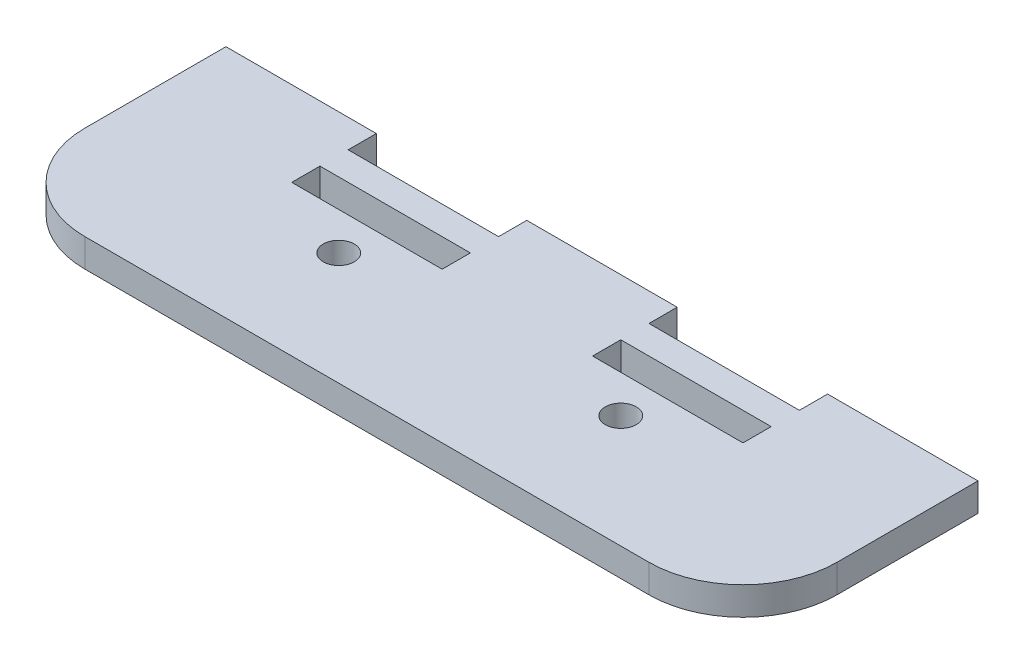
ISO-10303-21;
HEADER;
FILE_DESCRIPTION(('STEP AP214'),'2;1');
FILE_NAME('part.step','',(''),(''),'','','');
FILE_SCHEMA(('AUTOMOTIVE_DESIGN { 1 0 10303 214 1 1 1 1 }'));
ENDSEC;
DATA;
#1=APPLICATION_CONTEXT('core data for automotive mechanical design processes');
#2=APPLICATION_PROTOCOL_DEFINITION('international standard','automotive_design',2000,#1);
#3=PRODUCT_CONTEXT('',#1,'mechanical');
#4=PRODUCT('Part','Part','',(#3));
#5=PRODUCT_RELATED_PRODUCT_CATEGORY('part','',(#4));
#6=PRODUCT_DEFINITION_FORMATION('','',#4);
#7=PRODUCT_DEFINITION_CONTEXT('part definition',#1,'design');
#8=PRODUCT_DEFINITION('design','',#6,#7);
#9=PRODUCT_DEFINITION_SHAPE('','',#8);
#10=(LENGTH_UNIT() NAMED_UNIT(*) SI_UNIT(.MILLI.,.METRE.));
#11=(NAMED_UNIT(*) PLANE_ANGLE_UNIT() SI_UNIT($,.RADIAN.));
#12=(NAMED_UNIT(*) SI_UNIT($,.STERADIAN.) SOLID_ANGLE_UNIT());
#13=UNCERTAINTY_MEASURE_WITH_UNIT(LENGTH_MEASURE(1.E-05),#10,'distance_accuracy_value','');
#14=(GEOMETRIC_REPRESENTATION_CONTEXT(3) GLOBAL_UNCERTAINTY_ASSIGNED_CONTEXT((#13)) GLOBAL_UNIT_ASSIGNED_CONTEXT((#10,
#11,#12)) REPRESENTATION_CONTEXT('',''));
#15=CARTESIAN_POINT('',(0.,0.,0.));
#16=DIRECTION('',(0.,0.,1.));
#17=DIRECTION('',(1.,0.,0.));
#18=AXIS2_PLACEMENT_3D('',#15,#16,#17);
#19=CARTESIAN_POINT('',(-30.,3.,2.50000000000001));
#20=DIRECTION('',(0.,1.,0.));
#21=DIRECTION('',(0.,0.,1.));
#22=AXIS2_PLACEMENT_3D('',#19,#20,#21);
#23=PLANE('',#22);
#24=CARTESIAN_POINT('',(-15.,3.,0.500000000000002));
#25=DIRECTION('',(0.,1.,0.));
#26=DIRECTION('',(0.,0.,1.));
#27=AXIS2_PLACEMENT_3D('',#24,#25,#26);
#28=CIRCLE('',#27,1.65);
#29=CARTESIAN_POINT('',(-15.,3.,2.15));
#30=VERTEX_POINT('',#29);
#31=EDGE_CURVE('E257',#30,#30,#28,.T.);
#32=ORIENTED_EDGE('',*,*,#31,.F.);
#33=EDGE_LOOP('',(#32));
#34=FACE_BOUND('',#33,.T.);
#35=DIRECTION('',(-1.,0.,0.));
#36=VECTOR('',#35,1.);
#37=CARTESIAN_POINT('',(-24.,3.,-12.5));
#38=LINE('',#37,#36);
#39=CARTESIAN_POINT('',(-24.,3.,-12.5));
#40=VERTEX_POINT('',#39);
#41=CARTESIAN_POINT('',(-40.,3.,-12.5));
#42=VERTEX_POINT('',#41);
#43=EDGE_CURVE('E263',#40,#42,#38,.T.);
#44=ORIENTED_EDGE('',*,*,#43,.T.);
#45=DIRECTION('',(0.,0.,1.));
#46=VECTOR('',#45,1.);
#47=CARTESIAN_POINT('',(-40.,3.,2.49999999999994));
#48=LINE('',#47,#46);
#49=CARTESIAN_POINT('',(-40.,3.,2.49999999999994));
#50=VERTEX_POINT('',#49);
#51=EDGE_CURVE('E266',#42,#50,#48,.T.);
#52=ORIENTED_EDGE('',*,*,#51,.T.);
#53=CARTESIAN_POINT('',(-30.,3.,2.50000000000001));
#54=DIRECTION('',(0.,1.,0.));
#55=DIRECTION('',(0.,0.,1.));
#56=AXIS2_PLACEMENT_3D('',#53,#54,#55);
#57=CIRCLE('',#56,10.);
#58=CARTESIAN_POINT('',(-30.,3.,12.5));
#59=VERTEX_POINT('',#58);
#60=EDGE_CURVE('E269',#50,#59,#57,.T.);
#61=ORIENTED_EDGE('',*,*,#60,.T.);
#62=DIRECTION('',(1.,0.,0.));
#63=VECTOR('',#62,1.);
#64=CARTESIAN_POINT('',(29.9999999999999,3.,12.5));
#65=LINE('',#64,#63);
#66=CARTESIAN_POINT('',(29.9999999999999,3.,12.5));
#67=VERTEX_POINT('',#66);
#68=EDGE_CURVE('E271',#59,#67,#65,.T.);
#69=ORIENTED_EDGE('',*,*,#68,.T.);
#70=CARTESIAN_POINT('',(30.,3.,2.5));
#71=DIRECTION('',(0.,1.,0.));
#72=DIRECTION('',(0.,0.,-1.));
#73=AXIS2_PLACEMENT_3D('',#70,#71,#72);
#74=CIRCLE('',#73,10.);
#75=CARTESIAN_POINT('',(40.,3.,2.49999999999993));
#76=VERTEX_POINT('',#75);
#77=EDGE_CURVE('E273',#67,#76,#74,.T.);
#78=ORIENTED_EDGE('',*,*,#77,.T.);
#79=DIRECTION('',(0.,0.,-1.));
#80=VECTOR('',#79,1.);
#81=CARTESIAN_POINT('',(40.,3.,2.49999999999993));
#82=LINE('',#81,#80);
#83=CARTESIAN_POINT('',(40.,3.,-12.5));
#84=VERTEX_POINT('',#83);
#85=EDGE_CURVE('E275',#76,#84,#82,.T.);
#86=ORIENTED_EDGE('',*,*,#85,.T.);
#87=DIRECTION('',(-1.,0.,0.));
#88=VECTOR('',#87,1.);
#89=CARTESIAN_POINT('',(40.,3.,-12.5));
#90=LINE('',#89,#88);
#91=CARTESIAN_POINT('',(24.,3.,-12.5));
#92=VERTEX_POINT('',#91);
#93=EDGE_CURVE('E277',#84,#92,#90,.T.);
#94=ORIENTED_EDGE('',*,*,#93,.T.);
#95=DIRECTION('',(0.,0.,1.));
#96=VECTOR('',#95,1.);
#97=CARTESIAN_POINT('',(24.,3.,-9.5));
#98=LINE('',#97,#96);
#99=CARTESIAN_POINT('',(24.,3.,-9.5));
#100=VERTEX_POINT('',#99);
#101=EDGE_CURVE('E279',#92,#100,#98,.T.);
#102=ORIENTED_EDGE('',*,*,#101,.T.);
#103=DIRECTION('',(-1.,0.,0.));
#104=VECTOR('',#103,1.);
#105=CARTESIAN_POINT('',(24.,3.,-9.5));
#106=LINE('',#105,#104);
#107=CARTESIAN_POINT('',(8.,3.,-9.5));
#108=VERTEX_POINT('',#107);
#109=EDGE_CURVE('E281',#100,#108,#106,.T.);
#110=ORIENTED_EDGE('',*,*,#109,.T.);
#111=DIRECTION('',(0.,0.,-1.));
#112=VECTOR('',#111,1.);
#113=CARTESIAN_POINT('',(8.,3.,-9.5));
#114=LINE('',#113,#112);
#115=CARTESIAN_POINT('',(8.,3.,-12.5));
#116=VERTEX_POINT('',#115);
#117=EDGE_CURVE('E283',#108,#116,#114,.T.);
#118=ORIENTED_EDGE('',*,*,#117,.T.);
#119=DIRECTION('',(-1.,0.,0.));
#120=VECTOR('',#119,1.);
#121=CARTESIAN_POINT('',(8.,3.,-12.5));
#122=LINE('',#121,#120);
#123=CARTESIAN_POINT('',(-8.,3.,-12.5));
#124=VERTEX_POINT('',#123);
#125=EDGE_CURVE('E285',#116,#124,#122,.T.);
#126=ORIENTED_EDGE('',*,*,#125,.T.);
#127=DIRECTION('',(0.,0.,1.));
#128=VECTOR('',#127,1.);
#129=CARTESIAN_POINT('',(-8.,3.,-9.49999999999999));
#130=LINE('',#129,#128);
#131=CARTESIAN_POINT('',(-8.,3.,-9.49999999999999));
#132=VERTEX_POINT('',#131);
#133=EDGE_CURVE('E287',#124,#132,#130,.T.);
#134=ORIENTED_EDGE('',*,*,#133,.T.);
#135=DIRECTION('',(-1.,0.,0.));
#136=VECTOR('',#135,1.);
#137=CARTESIAN_POINT('',(-24.,3.,-9.49999999999999));
#138=LINE('',#137,#136);
#139=CARTESIAN_POINT('',(-24.,3.,-9.49999999999999));
#140=VERTEX_POINT('',#139);
#141=EDGE_CURVE('E289',#132,#140,#138,.T.);
#142=ORIENTED_EDGE('',*,*,#141,.T.);
#143=DIRECTION('',(0.,0.,-1.));
#144=VECTOR('',#143,1.);
#145=CARTESIAN_POINT('',(-24.,3.,-9.49999999999999));
#146=LINE('',#145,#144);
#147=EDGE_CURVE('E291',#140,#40,#146,.T.);
#148=ORIENTED_EDGE('',*,*,#147,.T.);
#149=EDGE_LOOP('',(#44,#52,#61,#69,#78,#86,#94,#102,#110,#118,#126,#134,#142,#148));
#150=FACE_BOUND('',#149,.T.);
#151=CARTESIAN_POINT('',(15.,3.,0.5));
#152=DIRECTION('',(0.,1.,0.));
#153=DIRECTION('',(0.,0.,1.));
#154=AXIS2_PLACEMENT_3D('',#151,#152,#153);
#155=CIRCLE('',#154,1.65);
#156=CARTESIAN_POINT('',(15.,3.,2.15));
#157=VERTEX_POINT('',#156);
#158=EDGE_CURVE('E251',#157,#157,#155,.T.);
#159=ORIENTED_EDGE('',*,*,#158,.F.);
#160=EDGE_LOOP('',(#159));
#161=FACE_BOUND('',#160,.T.);
#162=DIRECTION('',(-1.,0.,0.));
#163=VECTOR('',#162,1.);
#164=CARTESIAN_POINT('',(-24.,3.,-6.49999999999999));
#165=LINE('',#164,#163);
#166=CARTESIAN_POINT('',(-8.,3.,-6.49999999999999));
#167=VERTEX_POINT('',#166);
#168=CARTESIAN_POINT('',(-24.,3.,-6.49999999999999));
#169=VERTEX_POINT('',#168);
#170=EDGE_CURVE('E222',#167,#169,#165,.T.);
#171=ORIENTED_EDGE('',*,*,#170,.F.);
#172=DIRECTION('',(0.,0.,-1.));
#173=VECTOR('',#172,1.);
#174=CARTESIAN_POINT('',(-8.,3.,-3.49999999999999));
#175=LINE('',#174,#173);
#176=CARTESIAN_POINT('',(-8.,3.,-3.49999999999999));
#177=VERTEX_POINT('',#176);
#178=EDGE_CURVE('E220',#177,#167,#175,.T.);
#179=ORIENTED_EDGE('',*,*,#178,.F.);
#180=DIRECTION('',(1.,0.,0.));
#181=VECTOR('',#180,1.);
#182=CARTESIAN_POINT('',(-24.,3.,-3.49999999999999));
#183=LINE('',#182,#181);
#184=CARTESIAN_POINT('',(-24.,3.,-3.49999999999999));
#185=VERTEX_POINT('',#184);
#186=EDGE_CURVE('E228',#185,#177,#183,.T.);
#187=ORIENTED_EDGE('',*,*,#186,.F.);
#188=DIRECTION('',(0.,0.,1.));
#189=VECTOR('',#188,1.);
#190=CARTESIAN_POINT('',(-24.,3.,-6.49999999999999));
#191=LINE('',#190,#189);
#192=EDGE_CURVE('E225',#169,#185,#191,.T.);
#193=ORIENTED_EDGE('',*,*,#192,.F.);
#194=EDGE_LOOP('',(#171,#179,#187,#193));
#195=FACE_BOUND('',#194,.T.);
#196=DIRECTION('',(0.,0.,-1.));
#197=VECTOR('',#196,1.);
#198=CARTESIAN_POINT('',(24.,3.,-3.49999999999999));
#199=LINE('',#198,#197);
#200=CARTESIAN_POINT('',(24.,3.,-3.49999999999999));
#201=VERTEX_POINT('',#200);
#202=CARTESIAN_POINT('',(24.,3.,-6.49999999999999));
#203=VERTEX_POINT('',#202);
#204=EDGE_CURVE('E192',#201,#203,#199,.T.);
#205=ORIENTED_EDGE('',*,*,#204,.F.);
#206=DIRECTION('',(1.,0.,0.));
#207=VECTOR('',#206,1.);
#208=CARTESIAN_POINT('',(8.,3.,-3.49999999999999));
#209=LINE('',#208,#207);
#210=CARTESIAN_POINT('',(8.,3.,-3.49999999999999));
#211=VERTEX_POINT('',#210);
#212=EDGE_CURVE('E184',#211,#201,#209,.T.);
#213=ORIENTED_EDGE('',*,*,#212,.F.);
#214=DIRECTION('',(0.,0.,1.));
#215=VECTOR('',#214,1.);
#216=CARTESIAN_POINT('',(8.,3.,-6.49999999999999));
#217=LINE('',#216,#215);
#218=CARTESIAN_POINT('',(8.,3.,-6.49999999999999));
#219=VERTEX_POINT('',#218);
#220=EDGE_CURVE('E206',#219,#211,#217,.T.);
#221=ORIENTED_EDGE('',*,*,#220,.F.);
#222=DIRECTION('',(-1.,0.,0.));
#223=VECTOR('',#222,1.);
#224=CARTESIAN_POINT('',(8.,3.,-6.49999999999999));
#225=LINE('',#224,#223);
#226=EDGE_CURVE('E204',#203,#219,#225,.T.);
#227=ORIENTED_EDGE('',*,*,#226,.F.);
#228=EDGE_LOOP('',(#205,#213,#221,#227));
#229=FACE_BOUND('',#228,.T.);
#230=ADVANCED_FACE('F35',(#34,#150,#161,#195,#229),#23,.T.);
#231=CARTESIAN_POINT('',(-30.,0.,2.50000000000001));
#232=DIRECTION('',(0.,1.,0.));
#233=DIRECTION('',(0.,0.,1.));
#234=AXIS2_PLACEMENT_3D('',#231,#232,#233);
#235=PLANE('',#234);
#236=DIRECTION('',(0.,0.,-1.));
#237=VECTOR('',#236,1.);
#238=CARTESIAN_POINT('',(-8.,0.,-3.49999999999999));
#239=LINE('',#238,#237);
#240=CARTESIAN_POINT('',(-8.,0.,-3.49999999999999));
#241=VERTEX_POINT('',#240);
#242=CARTESIAN_POINT('',(-8.,0.,-6.49999999999999));
#243=VERTEX_POINT('',#242);
#244=EDGE_CURVE('E200',#241,#243,#239,.T.);
#245=ORIENTED_EDGE('',*,*,#244,.T.);
#246=DIRECTION('',(-1.,0.,0.));
#247=VECTOR('',#246,1.);
#248=CARTESIAN_POINT('',(-24.,0.,-6.49999999999999));
#249=LINE('',#248,#247);
#250=CARTESIAN_POINT('',(-24.,0.,-6.49999999999999));
#251=VERTEX_POINT('',#250);
#252=EDGE_CURVE('E233',#243,#251,#249,.T.);
#253=ORIENTED_EDGE('',*,*,#252,.T.);
#254=DIRECTION('',(0.,0.,1.));
#255=VECTOR('',#254,1.);
#256=CARTESIAN_POINT('',(-24.,0.,-6.49999999999999));
#257=LINE('',#256,#255);
#258=CARTESIAN_POINT('',(-24.,0.,-3.49999999999999));
#259=VERTEX_POINT('',#258);
#260=EDGE_CURVE('E236',#251,#259,#257,.T.);
#261=ORIENTED_EDGE('',*,*,#260,.T.);
#262=DIRECTION('',(1.,0.,0.));
#263=VECTOR('',#262,1.);
#264=CARTESIAN_POINT('',(-24.,0.,-3.49999999999999));
#265=LINE('',#264,#263);
#266=EDGE_CURVE('E223',#259,#241,#265,.T.);
#267=ORIENTED_EDGE('',*,*,#266,.T.);
#268=EDGE_LOOP('',(#245,#253,#261,#267));
#269=FACE_BOUND('',#268,.T.);
#270=DIRECTION('',(-1.,0.,0.));
#271=VECTOR('',#270,1.);
#272=CARTESIAN_POINT('',(-24.,0.,-12.5));
#273=LINE('',#272,#271);
#274=CARTESIAN_POINT('',(-24.,0.,-12.5));
#275=VERTEX_POINT('',#274);
#276=CARTESIAN_POINT('',(-40.,0.,-12.5));
#277=VERTEX_POINT('',#276);
#278=EDGE_CURVE('E260',#275,#277,#273,.T.);
#279=ORIENTED_EDGE('',*,*,#278,.F.);
#280=DIRECTION('',(0.,0.,-1.));
#281=VECTOR('',#280,1.);
#282=CARTESIAN_POINT('',(-24.,0.,-9.49999999999999));
#283=LINE('',#282,#281);
#284=CARTESIAN_POINT('',(-24.,0.,-9.49999999999999));
#285=VERTEX_POINT('',#284);
#286=EDGE_CURVE('E267',#285,#275,#283,.T.);
#287=ORIENTED_EDGE('',*,*,#286,.F.);
#288=DIRECTION('',(-1.,0.,0.));
#289=VECTOR('',#288,1.);
#290=CARTESIAN_POINT('',(-24.,0.,-9.49999999999999));
#291=LINE('',#290,#289);
#292=CARTESIAN_POINT('',(-8.,0.,-9.49999999999999));
#293=VERTEX_POINT('',#292);
#294=EDGE_CURVE('E318',#293,#285,#291,.T.);
#295=ORIENTED_EDGE('',*,*,#294,.F.);
#296=DIRECTION('',(0.,0.,1.));
#297=VECTOR('',#296,1.);
#298=CARTESIAN_POINT('',(-8.,0.,-9.49999999999999));
#299=LINE('',#298,#297);
#300=CARTESIAN_POINT('',(-8.,0.,-12.5));
#301=VERTEX_POINT('',#300);
#302=EDGE_CURVE('E316',#301,#293,#299,.T.);
#303=ORIENTED_EDGE('',*,*,#302,.F.);
#304=DIRECTION('',(-1.,0.,0.));
#305=VECTOR('',#304,1.);
#306=CARTESIAN_POINT('',(8.,0.,-12.5));
#307=LINE('',#306,#305);
#308=CARTESIAN_POINT('',(8.,0.,-12.5));
#309=VERTEX_POINT('',#308);
#310=EDGE_CURVE('E314',#309,#301,#307,.T.);
#311=ORIENTED_EDGE('',*,*,#310,.F.);
#312=DIRECTION('',(0.,0.,-1.));
#313=VECTOR('',#312,1.);
#314=CARTESIAN_POINT('',(8.,0.,-9.5));
#315=LINE('',#314,#313);
#316=CARTESIAN_POINT('',(8.,0.,-9.5));
#317=VERTEX_POINT('',#316);
#318=EDGE_CURVE('E312',#317,#309,#315,.T.);
#319=ORIENTED_EDGE('',*,*,#318,.F.);
#320=DIRECTION('',(-1.,0.,0.));
#321=VECTOR('',#320,1.);
#322=CARTESIAN_POINT('',(24.,0.,-9.5));
#323=LINE('',#322,#321);
#324=CARTESIAN_POINT('',(24.,0.,-9.5));
#325=VERTEX_POINT('',#324);
#326=EDGE_CURVE('E310',#325,#317,#323,.T.);
#327=ORIENTED_EDGE('',*,*,#326,.F.);
#328=DIRECTION('',(0.,0.,1.));
#329=VECTOR('',#328,1.);
#330=CARTESIAN_POINT('',(24.,0.,-9.5));
#331=LINE('',#330,#329);
#332=CARTESIAN_POINT('',(24.,0.,-12.5));
#333=VERTEX_POINT('',#332);
#334=EDGE_CURVE('E308',#333,#325,#331,.T.);
#335=ORIENTED_EDGE('',*,*,#334,.F.);
#336=DIRECTION('',(-1.,0.,0.));
#337=VECTOR('',#336,1.);
#338=CARTESIAN_POINT('',(40.,0.,-12.5));
#339=LINE('',#338,#337);
#340=CARTESIAN_POINT('',(40.,0.,-12.5));
#341=VERTEX_POINT('',#340);
#342=EDGE_CURVE('E306',#341,#333,#339,.T.);
#343=ORIENTED_EDGE('',*,*,#342,.F.);
#344=DIRECTION('',(0.,0.,-1.));
#345=VECTOR('',#344,1.);
#346=CARTESIAN_POINT('',(40.,0.,2.49999999999993));
#347=LINE('',#346,#345);
#348=CARTESIAN_POINT('',(40.,0.,2.49999999999993));
#349=VERTEX_POINT('',#348);
#350=EDGE_CURVE('E304',#349,#341,#347,.T.);
#351=ORIENTED_EDGE('',*,*,#350,.F.);
#352=CARTESIAN_POINT('',(30.,0.,2.5));
#353=DIRECTION('',(0.,1.,0.));
#354=DIRECTION('',(0.,0.,-1.));
#355=AXIS2_PLACEMENT_3D('',#352,#353,#354);
#356=CIRCLE('',#355,10.);
#357=CARTESIAN_POINT('',(29.9999999999999,0.,12.5));
#358=VERTEX_POINT('',#357);
#359=EDGE_CURVE('E302',#358,#349,#356,.T.);
#360=ORIENTED_EDGE('',*,*,#359,.F.);
#361=DIRECTION('',(1.,0.,0.));
#362=VECTOR('',#361,1.);
#363=CARTESIAN_POINT('',(29.9999999999999,0.,12.5));
#364=LINE('',#363,#362);
#365=CARTESIAN_POINT('',(-30.,0.,12.5));
#366=VERTEX_POINT('',#365);
#367=EDGE_CURVE('E300',#366,#358,#364,.T.);
#368=ORIENTED_EDGE('',*,*,#367,.F.);
#369=CARTESIAN_POINT('',(-30.,0.,2.50000000000001));
#370=DIRECTION('',(0.,1.,0.));
#371=DIRECTION('',(0.,0.,1.));
#372=AXIS2_PLACEMENT_3D('',#369,#370,#371);
#373=CIRCLE('',#372,10.);
#374=CARTESIAN_POINT('',(-40.,0.,2.49999999999994));
#375=VERTEX_POINT('',#374);
#376=EDGE_CURVE('E298',#375,#366,#373,.T.);
#377=ORIENTED_EDGE('',*,*,#376,.F.);
#378=DIRECTION('',(0.,0.,1.));
#379=VECTOR('',#378,1.);
#380=CARTESIAN_POINT('',(-40.,0.,2.49999999999994));
#381=LINE('',#380,#379);
#382=EDGE_CURVE('E296',#277,#375,#381,.T.);
#383=ORIENTED_EDGE('',*,*,#382,.F.);
#384=EDGE_LOOP('',(#279,#287,#295,#303,#311,#319,#327,#335,#343,#351,#360,#368,#377,#383));
#385=FACE_BOUND('',#384,.T.);
#386=CARTESIAN_POINT('',(-15.,0.,0.500000000000002));
#387=DIRECTION('',(0.,1.,0.));
#388=DIRECTION('',(0.,0.,1.));
#389=AXIS2_PLACEMENT_3D('',#386,#387,#388);
#390=CIRCLE('',#389,1.65);
#391=CARTESIAN_POINT('',(-15.,0.,2.15));
#392=VERTEX_POINT('',#391);
#393=EDGE_CURVE('E254',#392,#392,#390,.T.);
#394=ORIENTED_EDGE('',*,*,#393,.T.);
#395=EDGE_LOOP('',(#394));
#396=FACE_BOUND('',#395,.T.);
#397=CARTESIAN_POINT('',(15.,0.,0.5));
#398=DIRECTION('',(0.,1.,0.));
#399=DIRECTION('',(0.,0.,1.));
#400=AXIS2_PLACEMENT_3D('',#397,#398,#399);
#401=CIRCLE('',#400,1.65);
#402=CARTESIAN_POINT('',(15.,0.,2.15));
#403=VERTEX_POINT('',#402);
#404=EDGE_CURVE('E250',#403,#403,#401,.T.);
#405=ORIENTED_EDGE('',*,*,#404,.T.);
#406=EDGE_LOOP('',(#405));
#407=FACE_BOUND('',#406,.T.);
#408=DIRECTION('',(1.,0.,0.));
#409=VECTOR('',#408,1.);
#410=CARTESIAN_POINT('',(8.,0.,-3.49999999999999));
#411=LINE('',#410,#409);
#412=CARTESIAN_POINT('',(8.,0.,-3.49999999999999));
#413=VERTEX_POINT('',#412);
#414=CARTESIAN_POINT('',(24.,0.,-3.49999999999999));
#415=VERTEX_POINT('',#414);
#416=EDGE_CURVE('E58',#413,#415,#411,.T.);
#417=ORIENTED_EDGE('',*,*,#416,.T.);
#418=DIRECTION('',(0.,0.,-1.));
#419=VECTOR('',#418,1.);
#420=CARTESIAN_POINT('',(24.,0.,-3.49999999999999));
#421=LINE('',#420,#419);
#422=CARTESIAN_POINT('',(24.,0.,-6.49999999999999));
#423=VERTEX_POINT('',#422);
#424=EDGE_CURVE('E199',#415,#423,#421,.T.);
#425=ORIENTED_EDGE('',*,*,#424,.T.);
#426=DIRECTION('',(-1.,0.,0.));
#427=VECTOR('',#426,1.);
#428=CARTESIAN_POINT('',(8.,0.,-6.49999999999999));
#429=LINE('',#428,#427);
#430=CARTESIAN_POINT('',(8.,0.,-6.49999999999999));
#431=VERTEX_POINT('',#430);
#432=EDGE_CURVE('E212',#423,#431,#429,.T.);
#433=ORIENTED_EDGE('',*,*,#432,.T.);
#434=DIRECTION('',(0.,0.,1.));
#435=VECTOR('',#434,1.);
#436=CARTESIAN_POINT('',(8.,0.,-6.49999999999999));
#437=LINE('',#436,#435);
#438=EDGE_CURVE('E193',#431,#413,#437,.T.);
#439=ORIENTED_EDGE('',*,*,#438,.T.);
#440=EDGE_LOOP('',(#417,#425,#433,#439));
#441=FACE_BOUND('',#440,.T.);
#442=ADVANCED_FACE('F366',(#269,#385,#396,#407,#441),#235,.F.);
#443=CARTESIAN_POINT('',(-24.,3.,-12.5));
#444=DIRECTION('',(0.,0.,1.));
#445=DIRECTION('',(1.,0.,0.));
#446=AXIS2_PLACEMENT_3D('',#443,#444,#445);
#447=PLANE('',#446);
#448=ORIENTED_EDGE('',*,*,#278,.T.);
#449=DIRECTION('',(0.,-1.,0.));
#450=VECTOR('',#449,1.);
#451=CARTESIAN_POINT('',(-40.,3.,-12.5));
#452=LINE('',#451,#450);
#453=EDGE_CURVE('E11',#42,#277,#452,.T.);
#454=ORIENTED_EDGE('',*,*,#453,.F.);
#455=ORIENTED_EDGE('',*,*,#43,.F.);
#456=DIRECTION('',(0.,-1.,0.));
#457=VECTOR('',#456,1.);
#458=CARTESIAN_POINT('',(-24.,3.,-12.5));
#459=LINE('',#458,#457);
#460=EDGE_CURVE('E293',#40,#275,#459,.T.);
#461=ORIENTED_EDGE('',*,*,#460,.T.);
#462=EDGE_LOOP('',(#448,#454,#455,#461));
#463=FACE_BOUND('',#462,.T.);
#464=ADVANCED_FACE('F37',(#463),#447,.F.);
#465=CARTESIAN_POINT('',(-40.,3.,2.49999999999994));
#466=DIRECTION('',(1.,0.,0.));
#467=DIRECTION('',(0.,0.,-1.));
#468=AXIS2_PLACEMENT_3D('',#465,#466,#467);
#469=PLANE('',#468);
#470=ORIENTED_EDGE('',*,*,#382,.T.);
#471=DIRECTION('',(0.,-1.,0.));
#472=VECTOR('',#471,1.);
#473=CARTESIAN_POINT('',(-40.,3.,2.49999999999994));
#474=LINE('',#473,#472);
#475=EDGE_CURVE('E43',#50,#375,#474,.T.);
#476=ORIENTED_EDGE('',*,*,#475,.F.);
#477=ORIENTED_EDGE('',*,*,#51,.F.);
#478=ORIENTED_EDGE('',*,*,#453,.T.);
#479=EDGE_LOOP('',(#470,#476,#477,#478));
#480=FACE_BOUND('',#479,.T.);
#481=ADVANCED_FACE('F384',(#480),#469,.F.);
#482=CARTESIAN_POINT('',(-30.,3.,2.50000000000001));
#483=DIRECTION('',(0.,-1.,0.));
#484=DIRECTION('',(0.,0.,-1.));
#485=AXIS2_PLACEMENT_3D('',#482,#483,#484);
#486=CYLINDRICAL_SURFACE('',#485,10.);
#487=ORIENTED_EDGE('',*,*,#376,.T.);
#488=DIRECTION('',(0.,-1.,0.));
#489=VECTOR('',#488,1.);
#490=CARTESIAN_POINT('',(-30.,3.,12.5));
#491=LINE('',#490,#489);
#492=EDGE_CURVE('E353',#59,#366,#491,.T.);
#493=ORIENTED_EDGE('',*,*,#492,.F.);
#494=ORIENTED_EDGE('',*,*,#60,.F.);
#495=ORIENTED_EDGE('',*,*,#475,.T.);
#496=EDGE_LOOP('',(#487,#493,#494,#495));
#497=FACE_BOUND('',#496,.T.);
#498=ADVANCED_FACE('F360',(#497),#486,.T.);
#499=CARTESIAN_POINT('',(29.9999999999999,3.,12.5));
#500=DIRECTION('',(0.,0.,-1.));
#501=DIRECTION('',(-1.,0.,0.));
#502=AXIS2_PLACEMENT_3D('',#499,#500,#501);
#503=PLANE('',#502);
#504=ORIENTED_EDGE('',*,*,#367,.T.);
#505=DIRECTION('',(0.,-1.,0.));
#506=VECTOR('',#505,1.);
#507=CARTESIAN_POINT('',(29.9999999999999,3.,12.5));
#508=LINE('',#507,#506);
#509=EDGE_CURVE('E350',#67,#358,#508,.T.);
#510=ORIENTED_EDGE('',*,*,#509,.F.);
#511=ORIENTED_EDGE('',*,*,#68,.F.);
#512=ORIENTED_EDGE('',*,*,#492,.T.);
#513=EDGE_LOOP('',(#504,#510,#511,#512));
#514=FACE_BOUND('',#513,.T.);
#515=ADVANCED_FACE('F372',(#514),#503,.F.);
#516=CARTESIAN_POINT('',(30.,3.,2.5));
#517=DIRECTION('',(0.,-1.,0.));
#518=DIRECTION('',(0.,0.,-1.));
#519=AXIS2_PLACEMENT_3D('',#516,#517,#518);
#520=CYLINDRICAL_SURFACE('',#519,10.);
#521=ORIENTED_EDGE('',*,*,#359,.T.);
#522=DIRECTION('',(0.,-1.,0.));
#523=VECTOR('',#522,1.);
#524=CARTESIAN_POINT('',(40.,3.,2.49999999999993));
#525=LINE('',#524,#523);
#526=EDGE_CURVE('E347',#76,#349,#525,.T.);
#527=ORIENTED_EDGE('',*,*,#526,.F.);
#528=ORIENTED_EDGE('',*,*,#77,.F.);
#529=ORIENTED_EDGE('',*,*,#509,.T.);
#530=EDGE_LOOP('',(#521,#527,#528,#529));
#531=FACE_BOUND('',#530,.T.);
#532=ADVANCED_FACE('F376',(#531),#520,.T.);
#533=CARTESIAN_POINT('',(40.,3.,2.49999999999993));
#534=DIRECTION('',(-1.,0.,0.));
#535=DIRECTION('',(0.,0.,1.));
#536=AXIS2_PLACEMENT_3D('',#533,#534,#535);
#537=PLANE('',#536);
#538=ORIENTED_EDGE('',*,*,#350,.T.);
#539=DIRECTION('',(0.,-1.,0.));
#540=VECTOR('',#539,1.);
#541=CARTESIAN_POINT('',(40.,3.,-12.5));
#542=LINE('',#541,#540);
#543=EDGE_CURVE('E344',#84,#341,#542,.T.);
#544=ORIENTED_EDGE('',*,*,#543,.F.);
#545=ORIENTED_EDGE('',*,*,#85,.F.);
#546=ORIENTED_EDGE('',*,*,#526,.T.);
#547=EDGE_LOOP('',(#538,#544,#545,#546));
#548=FACE_BOUND('',#547,.T.);
#549=ADVANCED_FACE('F427',(#548),#537,.F.);
#550=CARTESIAN_POINT('',(40.,3.,-12.5));
#551=DIRECTION('',(0.,0.,1.));
#552=DIRECTION('',(1.,0.,0.));
#553=AXIS2_PLACEMENT_3D('',#550,#551,#552);
#554=PLANE('',#553);
#555=ORIENTED_EDGE('',*,*,#342,.T.);
#556=DIRECTION('',(0.,-1.,0.));
#557=VECTOR('',#556,1.);
#558=CARTESIAN_POINT('',(24.,3.,-12.5));
#559=LINE('',#558,#557);
#560=EDGE_CURVE('E341',#92,#333,#559,.T.);
#561=ORIENTED_EDGE('',*,*,#560,.F.);
#562=ORIENTED_EDGE('',*,*,#93,.F.);
#563=ORIENTED_EDGE('',*,*,#543,.T.);
#564=EDGE_LOOP('',(#555,#561,#562,#563));
#565=FACE_BOUND('',#564,.T.);
#566=ADVANCED_FACE('F425',(#565),#554,.F.);
#567=CARTESIAN_POINT('',(24.,3.,-9.5));
#568=DIRECTION('',(1.,0.,0.));
#569=DIRECTION('',(0.,0.,-1.));
#570=AXIS2_PLACEMENT_3D('',#567,#568,#569);
#571=PLANE('',#570);
#572=ORIENTED_EDGE('',*,*,#334,.T.);
#573=DIRECTION('',(0.,-1.,0.));
#574=VECTOR('',#573,1.);
#575=CARTESIAN_POINT('',(24.,3.,-9.5));
#576=LINE('',#575,#574);
#577=EDGE_CURVE('E338',#100,#325,#576,.T.);
#578=ORIENTED_EDGE('',*,*,#577,.F.);
#579=ORIENTED_EDGE('',*,*,#101,.F.);
#580=ORIENTED_EDGE('',*,*,#560,.T.);
#581=EDGE_LOOP('',(#572,#578,#579,#580));
#582=FACE_BOUND('',#581,.T.);
#583=ADVANCED_FACE('F420',(#582),#571,.F.);
#584=CARTESIAN_POINT('',(24.,3.,-9.5));
#585=DIRECTION('',(0.,0.,1.));
#586=DIRECTION('',(1.,0.,0.));
#587=AXIS2_PLACEMENT_3D('',#584,#585,#586);
#588=PLANE('',#587);
#589=ORIENTED_EDGE('',*,*,#326,.T.);
#590=DIRECTION('',(0.,-1.,0.));
#591=VECTOR('',#590,1.);
#592=CARTESIAN_POINT('',(8.,3.,-9.5));
#593=LINE('',#592,#591);
#594=EDGE_CURVE('E335',#108,#317,#593,.T.);
#595=ORIENTED_EDGE('',*,*,#594,.F.);
#596=ORIENTED_EDGE('',*,*,#109,.F.);
#597=ORIENTED_EDGE('',*,*,#577,.T.);
#598=EDGE_LOOP('',(#589,#595,#596,#597));
#599=FACE_BOUND('',#598,.T.);
#600=ADVANCED_FACE('F415',(#599),#588,.F.);
#601=CARTESIAN_POINT('',(8.,3.,-9.5));
#602=DIRECTION('',(-1.,0.,0.));
#603=DIRECTION('',(0.,0.,1.));
#604=AXIS2_PLACEMENT_3D('',#601,#602,#603);
#605=PLANE('',#604);
#606=ORIENTED_EDGE('',*,*,#318,.T.);
#607=DIRECTION('',(0.,-1.,0.));
#608=VECTOR('',#607,1.);
#609=CARTESIAN_POINT('',(8.,3.,-12.5));
#610=LINE('',#609,#608);
#611=EDGE_CURVE('E332',#116,#309,#610,.T.);
#612=ORIENTED_EDGE('',*,*,#611,.F.);
#613=ORIENTED_EDGE('',*,*,#117,.F.);
#614=ORIENTED_EDGE('',*,*,#594,.T.);
#615=EDGE_LOOP('',(#606,#612,#613,#614));
#616=FACE_BOUND('',#615,.T.);
#617=ADVANCED_FACE('F411',(#616),#605,.F.);
#618=CARTESIAN_POINT('',(8.,3.,-12.5));
#619=DIRECTION('',(0.,0.,1.));
#620=DIRECTION('',(1.,0.,0.));
#621=AXIS2_PLACEMENT_3D('',#618,#619,#620);
#622=PLANE('',#621);
#623=ORIENTED_EDGE('',*,*,#310,.T.);
#624=DIRECTION('',(0.,-1.,0.));
#625=VECTOR('',#624,1.);
#626=CARTESIAN_POINT('',(-8.,3.,-12.5));
#627=LINE('',#626,#625);
#628=EDGE_CURVE('E329',#124,#301,#627,.T.);
#629=ORIENTED_EDGE('',*,*,#628,.F.);
#630=ORIENTED_EDGE('',*,*,#125,.F.);
#631=ORIENTED_EDGE('',*,*,#611,.T.);
#632=EDGE_LOOP('',(#623,#629,#630,#631));
#633=FACE_BOUND('',#632,.T.);
#634=ADVANCED_FACE('F406',(#633),#622,.F.);
#635=CARTESIAN_POINT('',(-8.,3.,-9.49999999999999));
#636=DIRECTION('',(1.,0.,0.));
#637=DIRECTION('',(0.,0.,-1.));
#638=AXIS2_PLACEMENT_3D('',#635,#636,#637);
#639=PLANE('',#638);
#640=ORIENTED_EDGE('',*,*,#302,.T.);
#641=DIRECTION('',(0.,-1.,0.));
#642=VECTOR('',#641,1.);
#643=CARTESIAN_POINT('',(-8.,3.,-9.49999999999999));
#644=LINE('',#643,#642);
#645=EDGE_CURVE('E326',#132,#293,#644,.T.);
#646=ORIENTED_EDGE('',*,*,#645,.F.);
#647=ORIENTED_EDGE('',*,*,#133,.F.);
#648=ORIENTED_EDGE('',*,*,#628,.T.);
#649=EDGE_LOOP('',(#640,#646,#647,#648));
#650=FACE_BOUND('',#649,.T.);
#651=ADVANCED_FACE('F400',(#650),#639,.F.);
#652=CARTESIAN_POINT('',(-24.,3.,-9.49999999999999));
#653=DIRECTION('',(0.,0.,1.));
#654=DIRECTION('',(1.,0.,0.));
#655=AXIS2_PLACEMENT_3D('',#652,#653,#654);
#656=PLANE('',#655);
#657=ORIENTED_EDGE('',*,*,#294,.T.);
#658=DIRECTION('',(0.,-1.,0.));
#659=VECTOR('',#658,1.);
#660=CARTESIAN_POINT('',(-24.,3.,-9.49999999999999));
#661=LINE('',#660,#659);
#662=EDGE_CURVE('E323',#140,#285,#661,.T.);
#663=ORIENTED_EDGE('',*,*,#662,.F.);
#664=ORIENTED_EDGE('',*,*,#141,.F.);
#665=ORIENTED_EDGE('',*,*,#645,.T.);
#666=EDGE_LOOP('',(#657,#663,#664,#665));
#667=FACE_BOUND('',#666,.T.);
#668=ADVANCED_FACE('F396',(#667),#656,.F.);
#669=CARTESIAN_POINT('',(-24.,3.,-9.49999999999999));
#670=DIRECTION('',(-1.,0.,0.));
#671=DIRECTION('',(0.,0.,1.));
#672=AXIS2_PLACEMENT_3D('',#669,#670,#671);
#673=PLANE('',#672);
#674=ORIENTED_EDGE('',*,*,#286,.T.);
#675=ORIENTED_EDGE('',*,*,#460,.F.);
#676=ORIENTED_EDGE('',*,*,#147,.F.);
#677=ORIENTED_EDGE('',*,*,#662,.T.);
#678=EDGE_LOOP('',(#674,#675,#676,#677));
#679=FACE_BOUND('',#678,.T.);
#680=ADVANCED_FACE('F391',(#679),#673,.F.);
#681=CARTESIAN_POINT('',(-15.,3.,0.500000000000002));
#682=DIRECTION('',(0.,-1.,0.));
#683=DIRECTION('',(0.,0.,-1.));
#684=AXIS2_PLACEMENT_3D('',#681,#682,#683);
#685=CYLINDRICAL_SURFACE('',#684,1.65);
#686=ORIENTED_EDGE('',*,*,#31,.T.);
#687=EDGE_LOOP('',(#686));
#688=FACE_BOUND('',#687,.T.);
#689=ORIENTED_EDGE('',*,*,#393,.F.);
#690=EDGE_LOOP('',(#689));
#691=FACE_BOUND('',#690,.T.);
#692=ADVANCED_FACE('F446',(#688,#691),#685,.F.);
#693=CARTESIAN_POINT('',(15.,3.,0.5));
#694=DIRECTION('',(0.,-1.,0.));
#695=DIRECTION('',(0.,0.,-1.));
#696=AXIS2_PLACEMENT_3D('',#693,#694,#695);
#697=CYLINDRICAL_SURFACE('',#696,1.65);
#698=ORIENTED_EDGE('',*,*,#158,.T.);
#699=EDGE_LOOP('',(#698));
#700=FACE_BOUND('',#699,.T.);
#701=ORIENTED_EDGE('',*,*,#404,.F.);
#702=EDGE_LOOP('',(#701));
#703=FACE_BOUND('',#702,.T.);
#704=ADVANCED_FACE('F496',(#700,#703),#697,.F.);
#705=CARTESIAN_POINT('',(-8.,3.,-3.49999999999999));
#706=DIRECTION('',(-1.,0.,0.));
#707=DIRECTION('',(0.,0.,1.));
#708=AXIS2_PLACEMENT_3D('',#705,#706,#707);
#709=PLANE('',#708);
#710=ORIENTED_EDGE('',*,*,#244,.F.);
#711=DIRECTION('',(0.,-1.,0.));
#712=VECTOR('',#711,1.);
#713=CARTESIAN_POINT('',(-8.,3.,-3.49999999999999));
#714=LINE('',#713,#712);
#715=EDGE_CURVE('E230',#177,#241,#714,.T.);
#716=ORIENTED_EDGE('',*,*,#715,.F.);
#717=ORIENTED_EDGE('',*,*,#178,.T.);
#718=DIRECTION('',(0.,-1.,0.));
#719=VECTOR('',#718,1.);
#720=CARTESIAN_POINT('',(-8.,3.,-6.49999999999999));
#721=LINE('',#720,#719);
#722=EDGE_CURVE('E247',#167,#243,#721,.T.);
#723=ORIENTED_EDGE('',*,*,#722,.T.);
#724=EDGE_LOOP('',(#710,#716,#717,#723));
#725=FACE_BOUND('',#724,.T.);
#726=ADVANCED_FACE('F503',(#725),#709,.T.);
#727=CARTESIAN_POINT('',(-24.,3.,-6.49999999999999));
#728=DIRECTION('',(0.,0.,1.));
#729=DIRECTION('',(1.,0.,0.));
#730=AXIS2_PLACEMENT_3D('',#727,#728,#729);
#731=PLANE('',#730);
#732=ORIENTED_EDGE('',*,*,#252,.F.);
#733=ORIENTED_EDGE('',*,*,#722,.F.);
#734=ORIENTED_EDGE('',*,*,#170,.T.);
#735=DIRECTION('',(0.,-1.,0.));
#736=VECTOR('',#735,1.);
#737=CARTESIAN_POINT('',(-24.,3.,-6.49999999999999));
#738=LINE('',#737,#736);
#739=EDGE_CURVE('E245',#169,#251,#738,.T.);
#740=ORIENTED_EDGE('',*,*,#739,.T.);
#741=EDGE_LOOP('',(#732,#733,#734,#740));
#742=FACE_BOUND('',#741,.T.);
#743=ADVANCED_FACE('F510',(#742),#731,.T.);
#744=CARTESIAN_POINT('',(-24.,3.,-6.49999999999999));
#745=DIRECTION('',(1.,0.,0.));
#746=DIRECTION('',(0.,0.,-1.));
#747=AXIS2_PLACEMENT_3D('',#744,#745,#746);
#748=PLANE('',#747);
#749=ORIENTED_EDGE('',*,*,#260,.F.);
#750=ORIENTED_EDGE('',*,*,#739,.F.);
#751=ORIENTED_EDGE('',*,*,#192,.T.);
#752=DIRECTION('',(0.,-1.,0.));
#753=VECTOR('',#752,1.);
#754=CARTESIAN_POINT('',(-24.,3.,-3.49999999999999));
#755=LINE('',#754,#753);
#756=EDGE_CURVE('E243',#185,#259,#755,.T.);
#757=ORIENTED_EDGE('',*,*,#756,.T.);
#758=EDGE_LOOP('',(#749,#750,#751,#757));
#759=FACE_BOUND('',#758,.T.);
#760=ADVANCED_FACE('F518',(#759),#748,.T.);
#761=CARTESIAN_POINT('',(-24.,3.,-3.49999999999999));
#762=DIRECTION('',(0.,0.,-1.));
#763=DIRECTION('',(-1.,0.,0.));
#764=AXIS2_PLACEMENT_3D('',#761,#762,#763);
#765=PLANE('',#764);
#766=ORIENTED_EDGE('',*,*,#266,.F.);
#767=ORIENTED_EDGE('',*,*,#756,.F.);
#768=ORIENTED_EDGE('',*,*,#186,.T.);
#769=ORIENTED_EDGE('',*,*,#715,.T.);
#770=EDGE_LOOP('',(#766,#767,#768,#769));
#771=FACE_BOUND('',#770,.T.);
#772=ADVANCED_FACE('F526',(#771),#765,.T.);
#773=CARTESIAN_POINT('',(8.,3.,-3.49999999999999));
#774=DIRECTION('',(0.,0.,-1.));
#775=DIRECTION('',(-1.,0.,0.));
#776=AXIS2_PLACEMENT_3D('',#773,#774,#775);
#777=PLANE('',#776);
#778=ORIENTED_EDGE('',*,*,#416,.F.);
#779=DIRECTION('',(0.,-1.,0.));
#780=VECTOR('',#779,1.);
#781=CARTESIAN_POINT('',(8.,3.,-3.49999999999999));
#782=LINE('',#781,#780);
#783=EDGE_CURVE('E188',#211,#413,#782,.T.);
#784=ORIENTED_EDGE('',*,*,#783,.F.);
#785=ORIENTED_EDGE('',*,*,#212,.T.);
#786=DIRECTION('',(0.,-1.,0.));
#787=VECTOR('',#786,1.);
#788=CARTESIAN_POINT('',(24.,3.,-3.49999999999999));
#789=LINE('',#788,#787);
#790=EDGE_CURVE('E187',#201,#415,#789,.T.);
#791=ORIENTED_EDGE('',*,*,#790,.T.);
#792=EDGE_LOOP('',(#778,#784,#785,#791));
#793=FACE_BOUND('',#792,.T.);
#794=ADVANCED_FACE('F186',(#793),#777,.T.);
#795=CARTESIAN_POINT('',(24.,3.,-3.49999999999999));
#796=DIRECTION('',(-1.,0.,0.));
#797=DIRECTION('',(0.,0.,1.));
#798=AXIS2_PLACEMENT_3D('',#795,#796,#797);
#799=PLANE('',#798);
#800=ORIENTED_EDGE('',*,*,#424,.F.);
#801=ORIENTED_EDGE('',*,*,#790,.F.);
#802=ORIENTED_EDGE('',*,*,#204,.T.);
#803=DIRECTION('',(0.,-1.,0.));
#804=VECTOR('',#803,1.);
#805=CARTESIAN_POINT('',(24.,3.,-6.49999999999999));
#806=LINE('',#805,#804);
#807=EDGE_CURVE('E201',#203,#423,#806,.T.);
#808=ORIENTED_EDGE('',*,*,#807,.T.);
#809=EDGE_LOOP('',(#800,#801,#802,#808));
#810=FACE_BOUND('',#809,.T.);
#811=ADVANCED_FACE('F196',(#810),#799,.T.);
#812=CARTESIAN_POINT('',(8.,3.,-6.49999999999999));
#813=DIRECTION('',(0.,0.,1.));
#814=DIRECTION('',(1.,0.,0.));
#815=AXIS2_PLACEMENT_3D('',#812,#813,#814);
#816=PLANE('',#815);
#817=ORIENTED_EDGE('',*,*,#432,.F.);
#818=ORIENTED_EDGE('',*,*,#807,.F.);
#819=ORIENTED_EDGE('',*,*,#226,.T.);
#820=DIRECTION('',(0.,-1.,0.));
#821=VECTOR('',#820,1.);
#822=CARTESIAN_POINT('',(8.,3.,-6.49999999999999));
#823=LINE('',#822,#821);
#824=EDGE_CURVE('E50',#219,#431,#823,.T.);
#825=ORIENTED_EDGE('',*,*,#824,.T.);
#826=EDGE_LOOP('',(#817,#818,#819,#825));
#827=FACE_BOUND('',#826,.T.);
#828=ADVANCED_FACE('F547',(#827),#816,.T.);
#829=CARTESIAN_POINT('',(8.,3.,-6.49999999999999));
#830=DIRECTION('',(1.,0.,0.));
#831=DIRECTION('',(0.,0.,-1.));
#832=AXIS2_PLACEMENT_3D('',#829,#830,#831);
#833=PLANE('',#832);
#834=ORIENTED_EDGE('',*,*,#438,.F.);
#835=ORIENTED_EDGE('',*,*,#824,.F.);
#836=ORIENTED_EDGE('',*,*,#220,.T.);
#837=ORIENTED_EDGE('',*,*,#783,.T.);
#838=EDGE_LOOP('',(#834,#835,#836,#837));
#839=FACE_BOUND('',#838,.T.);
#840=ADVANCED_FACE('F554',(#839),#833,.T.);
#841=CLOSED_SHELL('',(#230,#442,#464,#481,#498,#515,#532,#549,#566,#583,#600,#617,#634,#651,
#668,#680,#692,#704,#726,#743,#760,#772,#794,#811,#828,#840));
#842=MANIFOLD_SOLID_BREP('B2',#841);
#843=ADVANCED_BREP_SHAPE_REPRESENTATION('',(#18,#842),#14);
#844=SHAPE_DEFINITION_REPRESENTATION(#9,#843);
ENDSEC;
END-ISO-10303-21;
